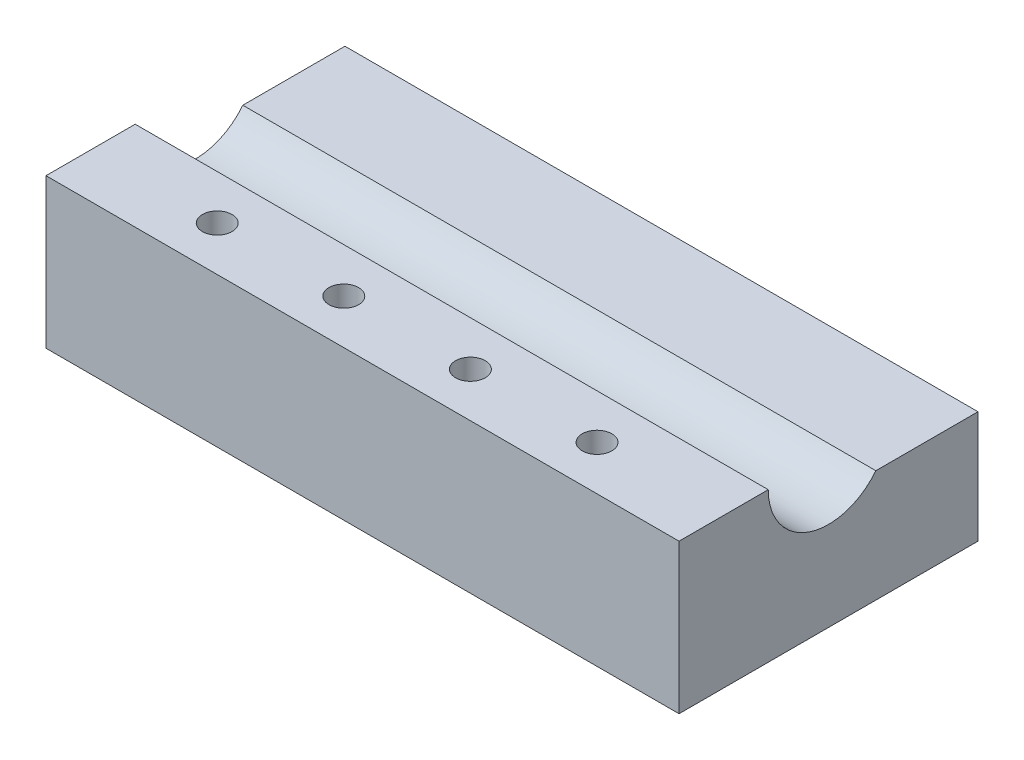
ISO-10303-21;
HEADER;
FILE_DESCRIPTION(('STEP AP214'),'2;1');
FILE_NAME('part.step','',(''),(''),'','','');
FILE_SCHEMA(('AUTOMOTIVE_DESIGN { 1 0 10303 214 1 1 1 1 }'));
ENDSEC;
DATA;
#1=APPLICATION_CONTEXT('core data for automotive mechanical design processes');
#2=APPLICATION_PROTOCOL_DEFINITION('international standard','automotive_design',2000,#1);
#3=PRODUCT_CONTEXT('',#1,'mechanical');
#4=PRODUCT('Part','Part','',(#3));
#5=PRODUCT_RELATED_PRODUCT_CATEGORY('part','',(#4));
#6=PRODUCT_DEFINITION_FORMATION('','',#4);
#7=PRODUCT_DEFINITION_CONTEXT('part definition',#1,'design');
#8=PRODUCT_DEFINITION('design','',#6,#7);
#9=PRODUCT_DEFINITION_SHAPE('','',#8);
#10=(LENGTH_UNIT() NAMED_UNIT(*) SI_UNIT(.MILLI.,.METRE.));
#11=(NAMED_UNIT(*) PLANE_ANGLE_UNIT() SI_UNIT($,.RADIAN.));
#12=(NAMED_UNIT(*) SI_UNIT($,.STERADIAN.) SOLID_ANGLE_UNIT());
#13=UNCERTAINTY_MEASURE_WITH_UNIT(LENGTH_MEASURE(1.E-05),#10,'distance_accuracy_value','');
#14=(GEOMETRIC_REPRESENTATION_CONTEXT(3) GLOBAL_UNCERTAINTY_ASSIGNED_CONTEXT((#13)) GLOBAL_UNIT_ASSIGNED_CONTEXT((#10,
#11,#12)) REPRESENTATION_CONTEXT('',''));
#15=CARTESIAN_POINT('',(0.,0.,0.));
#16=DIRECTION('',(0.,0.,1.));
#17=DIRECTION('',(1.,0.,0.));
#18=AXIS2_PLACEMENT_3D('',#15,#16,#17);
#19=CARTESIAN_POINT('',(0.,6.,0.));
#20=DIRECTION('',(0.,-1.,0.));
#21=DIRECTION('',(0.,0.,-1.));
#22=AXIS2_PLACEMENT_3D('',#19,#20,#21);
#23=PLANE('',#22);
#24=CARTESIAN_POINT('',(5.082,6.,-1.79));
#25=DIRECTION('',(0.,1.,0.));
#26=DIRECTION('',(0.,0.,1.));
#27=AXIS2_PLACEMENT_3D('',#24,#25,#26);
#28=CIRCLE('',#27,0.59563);
#29=CARTESIAN_POINT('',(5.082,6.,-1.19437));
#30=VERTEX_POINT('',#29);
#31=EDGE_CURVE('E220',#30,#30,#28,.T.);
#32=ORIENTED_EDGE('',*,*,#31,.F.);
#33=EDGE_LOOP('',(#32));
#34=FACE_BOUND('',#33,.T.);
#35=CARTESIAN_POINT('',(10.164,6.,-1.79));
#36=DIRECTION('',(0.,1.,0.));
#37=DIRECTION('',(0.,0.,1.));
#38=AXIS2_PLACEMENT_3D('',#35,#36,#37);
#39=CIRCLE('',#38,0.59563);
#40=CARTESIAN_POINT('',(10.164,6.,-1.19437));
#41=VERTEX_POINT('',#40);
#42=EDGE_CURVE('E212',#41,#41,#39,.T.);
#43=ORIENTED_EDGE('',*,*,#42,.F.);
#44=EDGE_LOOP('',(#43));
#45=FACE_BOUND('',#44,.T.);
#46=CARTESIAN_POINT('',(15.246,6.,-1.79));
#47=DIRECTION('',(0.,1.,0.));
#48=DIRECTION('',(0.,0.,1.));
#49=AXIS2_PLACEMENT_3D('',#46,#47,#48);
#50=CIRCLE('',#49,0.59563);
#51=CARTESIAN_POINT('',(15.246,6.,-1.19437));
#52=VERTEX_POINT('',#51);
#53=EDGE_CURVE('E204',#52,#52,#50,.T.);
#54=ORIENTED_EDGE('',*,*,#53,.F.);
#55=EDGE_LOOP('',(#54));
#56=FACE_BOUND('',#55,.T.);
#57=CARTESIAN_POINT('',(20.328,6.,-1.79));
#58=DIRECTION('',(0.,1.,0.));
#59=DIRECTION('',(0.,0.,1.));
#60=AXIS2_PLACEMENT_3D('',#57,#58,#59);
#61=CIRCLE('',#60,0.59563);
#62=CARTESIAN_POINT('',(20.328,6.,-1.19437));
#63=VERTEX_POINT('',#62);
#64=EDGE_CURVE('E196',#63,#63,#61,.T.);
#65=ORIENTED_EDGE('',*,*,#64,.F.);
#66=EDGE_LOOP('',(#65));
#67=FACE_BOUND('',#66,.T.);
#68=DIRECTION('',(0.,0.,-1.));
#69=VECTOR('',#68,1.);
#70=CARTESIAN_POINT('',(25.41,6.,0.));
#71=LINE('',#70,#69);
#72=CARTESIAN_POINT('',(25.41,6.,0.));
#73=VERTEX_POINT('',#72);
#74=CARTESIAN_POINT('',(25.41,6.,-3.58));
#75=VERTEX_POINT('',#74);
#76=EDGE_CURVE('E152',#73,#75,#71,.T.);
#77=ORIENTED_EDGE('',*,*,#76,.T.);
#78=DIRECTION('',(-1.,0.,0.));
#79=VECTOR('',#78,1.);
#80=CARTESIAN_POINT('',(25.41,6.,-3.58));
#81=LINE('',#80,#79);
#82=CARTESIAN_POINT('',(0.,6.,-3.58));
#83=VERTEX_POINT('',#82);
#84=EDGE_CURVE('E64',#75,#83,#81,.T.);
#85=ORIENTED_EDGE('',*,*,#84,.T.);
#86=DIRECTION('',(0.,0.,-1.));
#87=VECTOR('',#86,1.);
#88=CARTESIAN_POINT('',(0.,6.,0.));
#89=LINE('',#88,#87);
#90=CARTESIAN_POINT('',(0.,6.,0.));
#91=VERTEX_POINT('',#90);
#92=EDGE_CURVE('E115',#91,#83,#89,.T.);
#93=ORIENTED_EDGE('',*,*,#92,.F.);
#94=DIRECTION('',(1.,0.,0.));
#95=VECTOR('',#94,1.);
#96=CARTESIAN_POINT('',(0.,6.,0.));
#97=LINE('',#96,#95);
#98=EDGE_CURVE('E101',#91,#73,#97,.T.);
#99=ORIENTED_EDGE('',*,*,#98,.T.);
#100=EDGE_LOOP('',(#77,#85,#93,#99));
#101=FACE_BOUND('',#100,.T.);
#102=ADVANCED_FACE('F55',(#34,#45,#56,#67,#101),#23,.F.);
#103=CARTESIAN_POINT('',(0.,6.,0.));
#104=DIRECTION('',(-1.,0.,0.));
#105=DIRECTION('',(0.,0.,1.));
#106=AXIS2_PLACEMENT_3D('',#103,#104,#105);
#107=PLANE('',#106);
#108=DIRECTION('',(0.,0.,1.));
#109=VECTOR('',#108,1.);
#110=CARTESIAN_POINT('',(0.,4.5,-12.));
#111=LINE('',#110,#109);
#112=CARTESIAN_POINT('',(0.,4.5,-12.));
#113=VERTEX_POINT('',#112);
#114=CARTESIAN_POINT('',(0.,4.5,-7.89905239527508));
#115=VERTEX_POINT('',#114);
#116=EDGE_CURVE('E71',#113,#115,#111,.T.);
#117=ORIENTED_EDGE('',*,*,#116,.F.);
#118=DIRECTION('',(0.,-1.,0.));
#119=VECTOR('',#118,1.);
#120=CARTESIAN_POINT('',(0.,6.,-12.));
#121=LINE('',#120,#119);
#122=CARTESIAN_POINT('',(0.,0.,-12.));
#123=VERTEX_POINT('',#122);
#124=EDGE_CURVE('E118',#113,#123,#121,.T.);
#125=ORIENTED_EDGE('',*,*,#124,.T.);
#126=DIRECTION('',(0.,0.,-1.));
#127=VECTOR('',#126,1.);
#128=CARTESIAN_POINT('',(0.,0.,0.));
#129=LINE('',#128,#127);
#130=CARTESIAN_POINT('',(0.,0.,0.));
#131=VERTEX_POINT('',#130);
#132=EDGE_CURVE('E111',#131,#123,#129,.T.);
#133=ORIENTED_EDGE('',*,*,#132,.F.);
#134=DIRECTION('',(0.,-1.,0.));
#135=VECTOR('',#134,1.);
#136=CARTESIAN_POINT('',(0.,6.,0.));
#137=LINE('',#136,#135);
#138=EDGE_CURVE('E79',#91,#131,#137,.T.);
#139=ORIENTED_EDGE('',*,*,#138,.F.);
#140=ORIENTED_EDGE('',*,*,#92,.T.);
#141=CARTESIAN_POINT('',(0.,6.,-6.));
#142=DIRECTION('',(-1.,0.,0.));
#143=DIRECTION('',(0.,0.,1.));
#144=AXIS2_PLACEMENT_3D('',#141,#142,#143);
#145=CIRCLE('',#144,2.42);
#146=EDGE_CURVE('E130',#115,#83,#145,.T.);
#147=ORIENTED_EDGE('',*,*,#146,.F.);
#148=EDGE_LOOP('',(#117,#125,#133,#139,#140,#147));
#149=FACE_BOUND('',#148,.T.);
#150=ADVANCED_FACE('F57',(#149),#107,.T.);
#151=CARTESIAN_POINT('',(0.,6.,0.));
#152=DIRECTION('',(0.,0.,-1.));
#153=DIRECTION('',(-1.,0.,0.));
#154=AXIS2_PLACEMENT_3D('',#151,#152,#153);
#155=PLANE('',#154);
#156=DIRECTION('',(1.,0.,0.));
#157=VECTOR('',#156,1.);
#158=CARTESIAN_POINT('',(0.,0.,0.));
#159=LINE('',#158,#157);
#160=CARTESIAN_POINT('',(25.41,0.,0.));
#161=VERTEX_POINT('',#160);
#162=EDGE_CURVE('E99',#131,#161,#159,.T.);
#163=ORIENTED_EDGE('',*,*,#162,.T.);
#164=DIRECTION('',(0.,-1.,0.));
#165=VECTOR('',#164,1.);
#166=CARTESIAN_POINT('',(25.41,6.,0.));
#167=LINE('',#166,#165);
#168=EDGE_CURVE('E104',#73,#161,#167,.T.);
#169=ORIENTED_EDGE('',*,*,#168,.F.);
#170=ORIENTED_EDGE('',*,*,#98,.F.);
#171=ORIENTED_EDGE('',*,*,#138,.T.);
#172=EDGE_LOOP('',(#163,#169,#170,#171));
#173=FACE_BOUND('',#172,.T.);
#174=ADVANCED_FACE('F97',(#173),#155,.F.);
#175=CARTESIAN_POINT('',(25.41,6.,0.));
#176=DIRECTION('',(-1.,0.,0.));
#177=DIRECTION('',(0.,0.,1.));
#178=AXIS2_PLACEMENT_3D('',#175,#176,#177);
#179=PLANE('',#178);
#180=DIRECTION('',(0.,-1.,0.));
#181=VECTOR('',#180,1.);
#182=CARTESIAN_POINT('',(25.41,6.,-12.));
#183=LINE('',#182,#181);
#184=CARTESIAN_POINT('',(25.41,4.5,-12.));
#185=VERTEX_POINT('',#184);
#186=CARTESIAN_POINT('',(25.41,0.,-12.));
#187=VERTEX_POINT('',#186);
#188=EDGE_CURVE('E139',#185,#187,#183,.T.);
#189=ORIENTED_EDGE('',*,*,#188,.F.);
#190=DIRECTION('',(0.,0.,1.));
#191=VECTOR('',#190,1.);
#192=CARTESIAN_POINT('',(25.41,4.5,-12.));
#193=LINE('',#192,#191);
#194=CARTESIAN_POINT('',(25.41,4.5,-7.89905239527508));
#195=VERTEX_POINT('',#194);
#196=EDGE_CURVE('E170',#185,#195,#193,.T.);
#197=ORIENTED_EDGE('',*,*,#196,.T.);
#198=CARTESIAN_POINT('',(25.41,6.,-6.));
#199=DIRECTION('',(-1.,0.,0.));
#200=DIRECTION('',(0.,0.,1.));
#201=AXIS2_PLACEMENT_3D('',#198,#199,#200);
#202=CIRCLE('',#201,2.42);
#203=EDGE_CURVE('E122',#195,#75,#202,.T.);
#204=ORIENTED_EDGE('',*,*,#203,.T.);
#205=ORIENTED_EDGE('',*,*,#76,.F.);
#206=ORIENTED_EDGE('',*,*,#168,.T.);
#207=DIRECTION('',(0.,0.,-1.));
#208=VECTOR('',#207,1.);
#209=CARTESIAN_POINT('',(25.41,0.,0.));
#210=LINE('',#209,#208);
#211=EDGE_CURVE('E113',#161,#187,#210,.T.);
#212=ORIENTED_EDGE('',*,*,#211,.T.);
#213=EDGE_LOOP('',(#189,#197,#204,#205,#206,#212));
#214=FACE_BOUND('',#213,.T.);
#215=ADVANCED_FACE('F284',(#214),#179,.F.);
#216=CARTESIAN_POINT('',(0.,6.,-12.));
#217=DIRECTION('',(0.,0.,-1.));
#218=DIRECTION('',(-1.,0.,0.));
#219=AXIS2_PLACEMENT_3D('',#216,#217,#218);
#220=PLANE('',#219);
#221=DIRECTION('',(-1.,0.,0.));
#222=VECTOR('',#221,1.);
#223=CARTESIAN_POINT('',(25.41,4.5,-12.));
#224=LINE('',#223,#222);
#225=EDGE_CURVE('E166',#185,#113,#224,.T.);
#226=ORIENTED_EDGE('',*,*,#225,.F.);
#227=ORIENTED_EDGE('',*,*,#188,.T.);
#228=DIRECTION('',(1.,0.,0.));
#229=VECTOR('',#228,1.);
#230=CARTESIAN_POINT('',(0.,0.,-12.));
#231=LINE('',#230,#229);
#232=EDGE_CURVE('E121',#123,#187,#231,.T.);
#233=ORIENTED_EDGE('',*,*,#232,.F.);
#234=ORIENTED_EDGE('',*,*,#124,.F.);
#235=EDGE_LOOP('',(#226,#227,#233,#234));
#236=FACE_BOUND('',#235,.T.);
#237=ADVANCED_FACE('F280',(#236),#220,.T.);
#238=CARTESIAN_POINT('',(0.,0.,0.));
#239=DIRECTION('',(0.,-1.,0.));
#240=DIRECTION('',(0.,0.,-1.));
#241=AXIS2_PLACEMENT_3D('',#238,#239,#240);
#242=PLANE('',#241);
#243=CARTESIAN_POINT('',(23.91,0.,-6.));
#244=DIRECTION('',(0.,-1.,0.));
#245=DIRECTION('',(0.,0.,-1.));
#246=AXIS2_PLACEMENT_3D('',#243,#244,#245);
#247=CIRCLE('',#246,1.00000003199999);
#248=CARTESIAN_POINT('',(23.91,0.,-7.00000003199999));
#249=VERTEX_POINT('',#248);
#250=EDGE_CURVE('E188',#249,#249,#247,.T.);
#251=ORIENTED_EDGE('',*,*,#250,.F.);
#252=EDGE_LOOP('',(#251));
#253=FACE_BOUND('',#252,.T.);
#254=CARTESIAN_POINT('',(1.5,0.,-6.));
#255=DIRECTION('',(0.,-1.,0.));
#256=DIRECTION('',(0.,0.,-1.));
#257=AXIS2_PLACEMENT_3D('',#254,#255,#256);
#258=CIRCLE('',#257,1.00000003199999);
#259=CARTESIAN_POINT('',(1.5,0.,-7.00000003199999));
#260=VERTEX_POINT('',#259);
#261=EDGE_CURVE('E180',#260,#260,#258,.T.);
#262=ORIENTED_EDGE('',*,*,#261,.F.);
#263=EDGE_LOOP('',(#262));
#264=FACE_BOUND('',#263,.T.);
#265=ORIENTED_EDGE('',*,*,#132,.T.);
#266=ORIENTED_EDGE('',*,*,#232,.T.);
#267=ORIENTED_EDGE('',*,*,#211,.F.);
#268=ORIENTED_EDGE('',*,*,#162,.F.);
#269=EDGE_LOOP('',(#265,#266,#267,#268));
#270=FACE_BOUND('',#269,.T.);
#271=ADVANCED_FACE('F109',(#253,#264,#270),#242,.T.);
#272=CARTESIAN_POINT('',(25.41,6.,-6.));
#273=DIRECTION('',(-1.,0.,0.));
#274=DIRECTION('',(0.,0.,1.));
#275=AXIS2_PLACEMENT_3D('',#272,#273,#274);
#276=CYLINDRICAL_SURFACE('',#275,2.42);
#277=ORIENTED_EDGE('',*,*,#203,.F.);
#278=DIRECTION('',(-1.,0.,0.));
#279=VECTOR('',#278,1.);
#280=CARTESIAN_POINT('',(25.41,4.5,-7.89905239527508));
#281=LINE('',#280,#279);
#282=EDGE_CURVE('E13',#195,#115,#281,.T.);
#283=ORIENTED_EDGE('',*,*,#282,.T.);
#284=ORIENTED_EDGE('',*,*,#146,.T.);
#285=ORIENTED_EDGE('',*,*,#84,.F.);
#286=EDGE_LOOP('',(#277,#283,#284,#285));
#287=FACE_BOUND('',#286,.T.);
#288=ADVANCED_FACE('F275',(#287),#276,.F.);
#289=CARTESIAN_POINT('',(25.41,4.5,-12.));
#290=DIRECTION('',(0.,-1.,0.));
#291=DIRECTION('',(0.,0.,-1.));
#292=AXIS2_PLACEMENT_3D('',#289,#290,#291);
#293=PLANE('',#292);
#294=ORIENTED_EDGE('',*,*,#196,.F.);
#295=ORIENTED_EDGE('',*,*,#225,.T.);
#296=ORIENTED_EDGE('',*,*,#116,.T.);
#297=ORIENTED_EDGE('',*,*,#282,.F.);
#298=EDGE_LOOP('',(#294,#295,#296,#297));
#299=FACE_BOUND('',#298,.T.);
#300=ADVANCED_FACE('F271',(#299),#293,.F.);
#301=CARTESIAN_POINT('',(1.5,2.6491393617449,-6.));
#302=DIRECTION('',(0.,-1.,0.));
#303=DIRECTION('',(0.,0.,-1.));
#304=AXIS2_PLACEMENT_3D('',#301,#302,#303);
#305=CONICAL_SURFACE('',#304,1.000000032,1.02974425867665);
#306=CARTESIAN_POINT('',(1.5,3.25,-6.));
#307=VERTEX_POINT('',#306);
#308=VERTEX_LOOP('',#307);
#309=FACE_BOUND('',#308,.T.);
#310=CARTESIAN_POINT('',(1.5,2.6491393617449,-6.));
#311=DIRECTION('',(0.,-1.,0.));
#312=DIRECTION('',(0.,0.,-1.));
#313=AXIS2_PLACEMENT_3D('',#310,#311,#312);
#314=CIRCLE('',#313,1.000000032);
#315=CARTESIAN_POINT('',(1.5,2.6491393617449,-7.000000032));
#316=VERTEX_POINT('',#315);
#317=EDGE_CURVE('E173',#316,#316,#314,.T.);
#318=ORIENTED_EDGE('',*,*,#317,.T.);
#319=EDGE_LOOP('',(#318));
#320=FACE_BOUND('',#319,.T.);
#321=ADVANCED_FACE('F267',(#309,#320),#305,.F.);
#322=CARTESIAN_POINT('',(1.5,0.,-6.));
#323=DIRECTION('',(0.,-1.,0.));
#324=DIRECTION('',(0.,0.,-1.));
#325=AXIS2_PLACEMENT_3D('',#322,#323,#324);
#326=CYLINDRICAL_SURFACE('',#325,1.00000003199999);
#327=ORIENTED_EDGE('',*,*,#317,.F.);
#328=EDGE_LOOP('',(#327));
#329=FACE_BOUND('',#328,.T.);
#330=ORIENTED_EDGE('',*,*,#261,.T.);
#331=EDGE_LOOP('',(#330));
#332=FACE_BOUND('',#331,.T.);
#333=ADVANCED_FACE('F263',(#329,#332),#326,.F.);
#334=CARTESIAN_POINT('',(23.91,2.6491393617449,-6.));
#335=DIRECTION('',(0.,-1.,0.));
#336=DIRECTION('',(0.,0.,-1.));
#337=AXIS2_PLACEMENT_3D('',#334,#335,#336);
#338=CONICAL_SURFACE('',#337,1.000000032,1.02974425867665);
#339=CARTESIAN_POINT('',(23.91,3.25,-6.));
#340=VERTEX_POINT('',#339);
#341=VERTEX_LOOP('',#340);
#342=FACE_BOUND('',#341,.T.);
#343=CARTESIAN_POINT('',(23.91,2.6491393617449,-6.));
#344=DIRECTION('',(0.,-1.,0.));
#345=DIRECTION('',(0.,0.,-1.));
#346=AXIS2_PLACEMENT_3D('',#343,#344,#345);
#347=CIRCLE('',#346,1.000000032);
#348=CARTESIAN_POINT('',(23.91,2.6491393617449,-7.000000032));
#349=VERTEX_POINT('',#348);
#350=EDGE_CURVE('E184',#349,#349,#347,.T.);
#351=ORIENTED_EDGE('',*,*,#350,.T.);
#352=EDGE_LOOP('',(#351));
#353=FACE_BOUND('',#352,.T.);
#354=ADVANCED_FACE('F259',(#342,#353),#338,.F.);
#355=CARTESIAN_POINT('',(23.91,0.,-6.));
#356=DIRECTION('',(0.,-1.,0.));
#357=DIRECTION('',(0.,0.,-1.));
#358=AXIS2_PLACEMENT_3D('',#355,#356,#357);
#359=CYLINDRICAL_SURFACE('',#358,1.000000032);
#360=ORIENTED_EDGE('',*,*,#350,.F.);
#361=EDGE_LOOP('',(#360));
#362=FACE_BOUND('',#361,.T.);
#363=ORIENTED_EDGE('',*,*,#250,.T.);
#364=EDGE_LOOP('',(#363));
#365=FACE_BOUND('',#364,.T.);
#366=ADVANCED_FACE('F251',(#362,#365),#359,.F.);
#367=CARTESIAN_POINT('',(20.328,2.35789061051139,-1.79));
#368=DIRECTION('',(0.,1.,0.));
#369=DIRECTION('',(0.,0.,1.));
#370=AXIS2_PLACEMENT_3D('',#367,#368,#369);
#371=CONICAL_SURFACE('',#370,0.59563,1.02974425867665);
#372=CARTESIAN_POINT('',(20.328,2.,-1.79));
#373=VERTEX_POINT('',#372);
#374=VERTEX_LOOP('',#373);
#375=FACE_BOUND('',#374,.T.);
#376=CARTESIAN_POINT('',(20.328,2.35789061051139,-1.79));
#377=DIRECTION('',(0.,1.,0.));
#378=DIRECTION('',(0.,0.,1.));
#379=AXIS2_PLACEMENT_3D('',#376,#377,#378);
#380=CIRCLE('',#379,0.59563);
#381=CARTESIAN_POINT('',(20.328,2.35789061051139,-1.19437));
#382=VERTEX_POINT('',#381);
#383=EDGE_CURVE('E192',#382,#382,#380,.T.);
#384=ORIENTED_EDGE('',*,*,#383,.T.);
#385=EDGE_LOOP('',(#384));
#386=FACE_BOUND('',#385,.T.);
#387=ADVANCED_FACE('F241',(#375,#386),#371,.F.);
#388=CARTESIAN_POINT('',(20.328,6.,-1.79));
#389=DIRECTION('',(0.,1.,0.));
#390=DIRECTION('',(0.,0.,1.));
#391=AXIS2_PLACEMENT_3D('',#388,#389,#390);
#392=CYLINDRICAL_SURFACE('',#391,0.59563);
#393=ORIENTED_EDGE('',*,*,#383,.F.);
#394=EDGE_LOOP('',(#393));
#395=FACE_BOUND('',#394,.T.);
#396=ORIENTED_EDGE('',*,*,#64,.T.);
#397=EDGE_LOOP('',(#396));
#398=FACE_BOUND('',#397,.T.);
#399=ADVANCED_FACE('F238',(#395,#398),#392,.F.);
#400=CARTESIAN_POINT('',(15.246,2.35789061051139,-1.79));
#401=DIRECTION('',(0.,1.,0.));
#402=DIRECTION('',(0.,0.,1.));
#403=AXIS2_PLACEMENT_3D('',#400,#401,#402);
#404=CONICAL_SURFACE('',#403,0.59563,1.02974425867665);
#405=CARTESIAN_POINT('',(15.246,2.,-1.79));
#406=VERTEX_POINT('',#405);
#407=VERTEX_LOOP('',#406);
#408=FACE_BOUND('',#407,.T.);
#409=CARTESIAN_POINT('',(15.246,2.35789061051139,-1.79));
#410=DIRECTION('',(0.,1.,0.));
#411=DIRECTION('',(0.,0.,1.));
#412=AXIS2_PLACEMENT_3D('',#409,#410,#411);
#413=CIRCLE('',#412,0.59563);
#414=CARTESIAN_POINT('',(15.246,2.35789061051139,-1.19437));
#415=VERTEX_POINT('',#414);
#416=EDGE_CURVE('E200',#415,#415,#413,.T.);
#417=ORIENTED_EDGE('',*,*,#416,.T.);
#418=EDGE_LOOP('',(#417));
#419=FACE_BOUND('',#418,.T.);
#420=ADVANCED_FACE('F240',(#408,#419),#404,.F.);
#421=CARTESIAN_POINT('',(15.246,6.,-1.79));
#422=DIRECTION('',(0.,1.,0.));
#423=DIRECTION('',(0.,0.,1.));
#424=AXIS2_PLACEMENT_3D('',#421,#422,#423);
#425=CYLINDRICAL_SURFACE('',#424,0.59563);
#426=ORIENTED_EDGE('',*,*,#416,.F.);
#427=EDGE_LOOP('',(#426));
#428=FACE_BOUND('',#427,.T.);
#429=ORIENTED_EDGE('',*,*,#53,.T.);
#430=EDGE_LOOP('',(#429));
#431=FACE_BOUND('',#430,.T.);
#432=ADVANCED_FACE('F248',(#428,#431),#425,.F.);
#433=CARTESIAN_POINT('',(10.164,2.35789061051139,-1.79));
#434=DIRECTION('',(0.,1.,0.));
#435=DIRECTION('',(0.,0.,1.));
#436=AXIS2_PLACEMENT_3D('',#433,#434,#435);
#437=CONICAL_SURFACE('',#436,0.59563,1.02974425867665);
#438=CARTESIAN_POINT('',(10.164,2.,-1.79));
#439=VERTEX_POINT('',#438);
#440=VERTEX_LOOP('',#439);
#441=FACE_BOUND('',#440,.T.);
#442=CARTESIAN_POINT('',(10.164,2.35789061051139,-1.79));
#443=DIRECTION('',(0.,1.,0.));
#444=DIRECTION('',(0.,0.,1.));
#445=AXIS2_PLACEMENT_3D('',#442,#443,#444);
#446=CIRCLE('',#445,0.59563);
#447=CARTESIAN_POINT('',(10.164,2.35789061051139,-1.19437));
#448=VERTEX_POINT('',#447);
#449=EDGE_CURVE('E208',#448,#448,#446,.T.);
#450=ORIENTED_EDGE('',*,*,#449,.T.);
#451=EDGE_LOOP('',(#450));
#452=FACE_BOUND('',#451,.T.);
#453=ADVANCED_FACE('F332',(#441,#452),#437,.F.);
#454=CARTESIAN_POINT('',(10.164,6.,-1.79));
#455=DIRECTION('',(0.,1.,0.));
#456=DIRECTION('',(0.,0.,1.));
#457=AXIS2_PLACEMENT_3D('',#454,#455,#456);
#458=CYLINDRICAL_SURFACE('',#457,0.59563);
#459=ORIENTED_EDGE('',*,*,#449,.F.);
#460=EDGE_LOOP('',(#459));
#461=FACE_BOUND('',#460,.T.);
#462=ORIENTED_EDGE('',*,*,#42,.T.);
#463=EDGE_LOOP('',(#462));
#464=FACE_BOUND('',#463,.T.);
#465=ADVANCED_FACE('F321',(#461,#464),#458,.F.);
#466=CARTESIAN_POINT('',(5.082,2.35789061051139,-1.79));
#467=DIRECTION('',(0.,1.,0.));
#468=DIRECTION('',(0.,0.,1.));
#469=AXIS2_PLACEMENT_3D('',#466,#467,#468);
#470=CONICAL_SURFACE('',#469,0.595629999999999,1.02974425867665);
#471=CARTESIAN_POINT('',(5.082,2.,-1.79));
#472=VERTEX_POINT('',#471);
#473=VERTEX_LOOP('',#472);
#474=FACE_BOUND('',#473,.T.);
#475=CARTESIAN_POINT('',(5.082,2.35789061051139,-1.79));
#476=DIRECTION('',(0.,1.,0.));
#477=DIRECTION('',(0.,0.,1.));
#478=AXIS2_PLACEMENT_3D('',#475,#476,#477);
#479=CIRCLE('',#478,0.595629999999999);
#480=CARTESIAN_POINT('',(5.082,2.35789061051139,-1.19437));
#481=VERTEX_POINT('',#480);
#482=EDGE_CURVE('E216',#481,#481,#479,.T.);
#483=ORIENTED_EDGE('',*,*,#482,.T.);
#484=EDGE_LOOP('',(#483));
#485=FACE_BOUND('',#484,.T.);
#486=ADVANCED_FACE('F318',(#474,#485),#470,.F.);
#487=CARTESIAN_POINT('',(5.082,6.,-1.79));
#488=DIRECTION('',(0.,1.,0.));
#489=DIRECTION('',(0.,0.,1.));
#490=AXIS2_PLACEMENT_3D('',#487,#488,#489);
#491=CYLINDRICAL_SURFACE('',#490,0.595629999999999);
#492=ORIENTED_EDGE('',*,*,#482,.F.);
#493=EDGE_LOOP('',(#492));
#494=FACE_BOUND('',#493,.T.);
#495=ORIENTED_EDGE('',*,*,#31,.T.);
#496=EDGE_LOOP('',(#495));
#497=FACE_BOUND('',#496,.T.);
#498=ADVANCED_FACE('F227',(#494,#497),#491,.F.);
#499=CLOSED_SHELL('',(#102,#150,#174,#215,#237,#271,#288,#300,#321,#333,#354,#366,#387,#399,
#420,#432,#453,#465,#486,#498));
#500=MANIFOLD_SOLID_BREP('B2',#499);
#501=ADVANCED_BREP_SHAPE_REPRESENTATION('',(#18,#500),#14);
#502=SHAPE_DEFINITION_REPRESENTATION(#9,#501);
ENDSEC;
END-ISO-10303-21;
